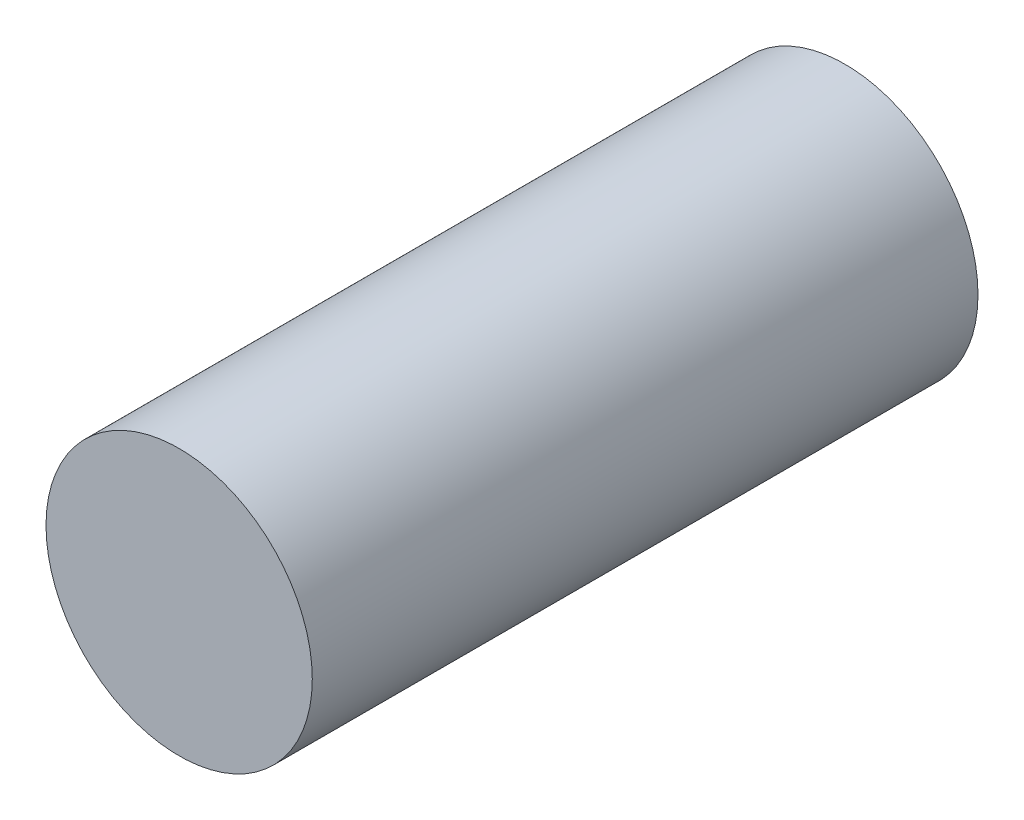
ISO-10303-21;
HEADER;
FILE_DESCRIPTION(('STEP AP214'),'2;1');
FILE_NAME('part.step','',(''),(''),'','','');
FILE_SCHEMA(('AUTOMOTIVE_DESIGN { 1 0 10303 214 1 1 1 1 }'));
ENDSEC;
DATA;
#1=APPLICATION_CONTEXT('core data for automotive mechanical design processes');
#2=APPLICATION_PROTOCOL_DEFINITION('international standard','automotive_design',2000,#1);
#3=PRODUCT_CONTEXT('',#1,'mechanical');
#4=PRODUCT('Part','Part','',(#3));
#5=PRODUCT_RELATED_PRODUCT_CATEGORY('part','',(#4));
#6=PRODUCT_DEFINITION_FORMATION('','',#4);
#7=PRODUCT_DEFINITION_CONTEXT('part definition',#1,'design');
#8=PRODUCT_DEFINITION('design','',#6,#7);
#9=PRODUCT_DEFINITION_SHAPE('','',#8);
#10=(LENGTH_UNIT() NAMED_UNIT(*) SI_UNIT(.MILLI.,.METRE.));
#11=(NAMED_UNIT(*) PLANE_ANGLE_UNIT() SI_UNIT($,.RADIAN.));
#12=(NAMED_UNIT(*) SI_UNIT($,.STERADIAN.) SOLID_ANGLE_UNIT());
#13=UNCERTAINTY_MEASURE_WITH_UNIT(LENGTH_MEASURE(1.E-05),#10,'distance_accuracy_value','');
#14=(GEOMETRIC_REPRESENTATION_CONTEXT(3) GLOBAL_UNCERTAINTY_ASSIGNED_CONTEXT((#13)) GLOBAL_UNIT_ASSIGNED_CONTEXT((#10,
#11,#12)) REPRESENTATION_CONTEXT('',''));
#15=CARTESIAN_POINT('',(0.,0.,0.));
#16=DIRECTION('',(0.,0.,1.));
#17=DIRECTION('',(1.,0.,0.));
#18=AXIS2_PLACEMENT_3D('',#15,#16,#17);
#19=CARTESIAN_POINT('',(-34.0583431072211,35.9010857142857,31.75));
#20=DIRECTION('',(0.,0.,-1.));
#21=DIRECTION('',(-1.,0.,0.));
#22=AXIS2_PLACEMENT_3D('',#19,#20,#21);
#23=CYLINDRICAL_SURFACE('',#22,6.35);
#24=CARTESIAN_POINT('',(-34.0583431072211,35.9010857142857,31.75));
#25=DIRECTION('',(0.,0.,1.));
#26=DIRECTION('',(1.,0.,0.));
#27=AXIS2_PLACEMENT_3D('',#24,#25,#26);
#28=CIRCLE('',#27,6.35);
#29=CARTESIAN_POINT('',(-27.7083431072211,35.9010857142857,31.75));
#30=VERTEX_POINT('',#29);
#31=EDGE_CURVE('E10',#30,#30,#28,.T.);
#32=ORIENTED_EDGE('',*,*,#31,.F.);
#33=EDGE_LOOP('',(#32));
#34=FACE_BOUND('',#33,.T.);
#35=CARTESIAN_POINT('',(-34.0583431072211,35.9010857142857,0.));
#36=DIRECTION('',(0.,0.,1.));
#37=DIRECTION('',(1.,0.,0.));
#38=AXIS2_PLACEMENT_3D('',#35,#36,#37);
#39=CIRCLE('',#38,6.35);
#40=CARTESIAN_POINT('',(-27.7083431072211,35.9010857142857,0.));
#41=VERTEX_POINT('',#40);
#42=EDGE_CURVE('E34',#41,#41,#39,.T.);
#43=ORIENTED_EDGE('',*,*,#42,.T.);
#44=EDGE_LOOP('',(#43));
#45=FACE_BOUND('',#44,.T.);
#46=ADVANCED_FACE('F31',(#34,#45),#23,.T.);
#47=CARTESIAN_POINT('',(-34.0583431072211,35.9010857142857,31.75));
#48=DIRECTION('',(0.,0.,1.));
#49=DIRECTION('',(1.,0.,0.));
#50=AXIS2_PLACEMENT_3D('',#47,#48,#49);
#51=PLANE('',#50);
#52=ORIENTED_EDGE('',*,*,#31,.T.);
#53=EDGE_LOOP('',(#52));
#54=FACE_BOUND('',#53,.T.);
#55=ADVANCED_FACE('F46',(#54),#51,.T.);
#56=CARTESIAN_POINT('',(-34.0583431072211,35.9010857142857,0.));
#57=DIRECTION('',(0.,0.,1.));
#58=DIRECTION('',(1.,0.,0.));
#59=AXIS2_PLACEMENT_3D('',#56,#57,#58);
#60=PLANE('',#59);
#61=ORIENTED_EDGE('',*,*,#42,.F.);
#62=EDGE_LOOP('',(#61));
#63=FACE_BOUND('',#62,.T.);
#64=ADVANCED_FACE('F44',(#63),#60,.F.);
#65=CLOSED_SHELL('',(#46,#55,#64));
#66=MANIFOLD_SOLID_BREP('B2',#65);
#67=ADVANCED_BREP_SHAPE_REPRESENTATION('',(#18,#66),#14);
#68=SHAPE_DEFINITION_REPRESENTATION(#9,#67);
ENDSEC;
END-ISO-10303-21;
